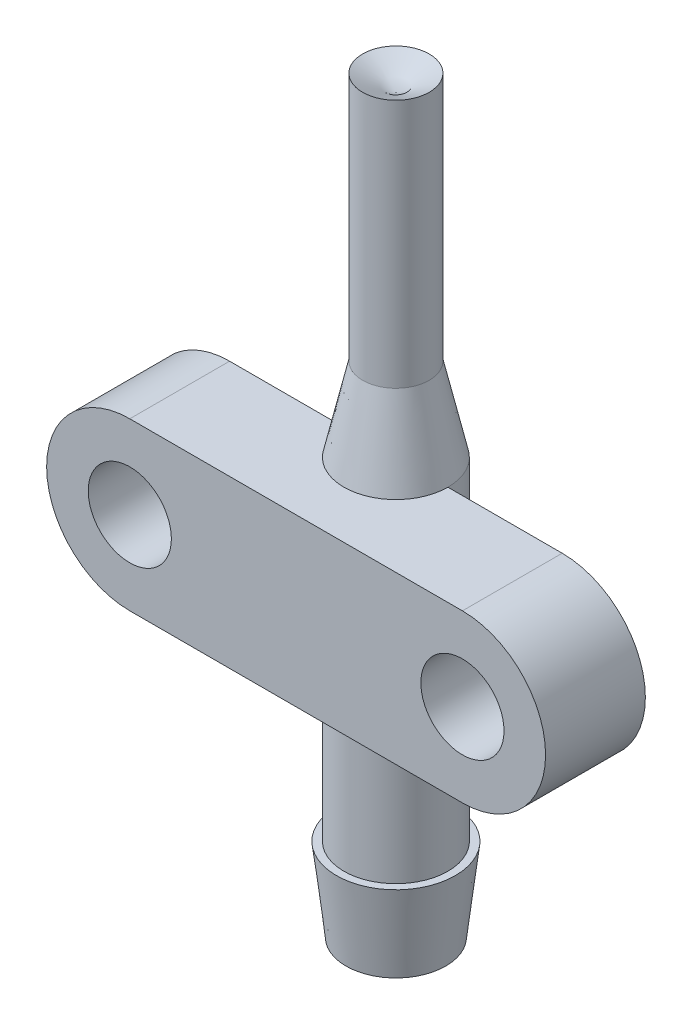
ISO-10303-21;
HEADER;
FILE_DESCRIPTION(('STEP AP214'),'2;1');
FILE_NAME('part.step','',(''),(''),'','','');
FILE_SCHEMA(('AUTOMOTIVE_DESIGN { 1 0 10303 214 1 1 1 1 }'));
ENDSEC;
DATA;
#1=APPLICATION_CONTEXT('core data for automotive mechanical design processes');
#2=APPLICATION_PROTOCOL_DEFINITION('international standard','automotive_design',2000,#1);
#3=PRODUCT_CONTEXT('',#1,'mechanical');
#4=PRODUCT('Part','Part','',(#3));
#5=PRODUCT_RELATED_PRODUCT_CATEGORY('part','',(#4));
#6=PRODUCT_DEFINITION_FORMATION('','',#4);
#7=PRODUCT_DEFINITION_CONTEXT('part definition',#1,'design');
#8=PRODUCT_DEFINITION('design','',#6,#7);
#9=PRODUCT_DEFINITION_SHAPE('','',#8);
#10=(LENGTH_UNIT() NAMED_UNIT(*) SI_UNIT(.MILLI.,.METRE.));
#11=(NAMED_UNIT(*) PLANE_ANGLE_UNIT() SI_UNIT($,.RADIAN.));
#12=(NAMED_UNIT(*) SI_UNIT($,.STERADIAN.) SOLID_ANGLE_UNIT());
#13=UNCERTAINTY_MEASURE_WITH_UNIT(LENGTH_MEASURE(1.E-05),#10,'distance_accuracy_value','');
#14=(GEOMETRIC_REPRESENTATION_CONTEXT(3) GLOBAL_UNCERTAINTY_ASSIGNED_CONTEXT((#13)) GLOBAL_UNIT_ASSIGNED_CONTEXT((#10,
#11,#12)) REPRESENTATION_CONTEXT('',''));
#15=CARTESIAN_POINT('',(0.,0.,0.));
#16=DIRECTION('',(0.,0.,1.));
#17=DIRECTION('',(1.,0.,0.));
#18=AXIS2_PLACEMENT_3D('',#15,#16,#17);
#19=CARTESIAN_POINT('',(-10.,20.,0.));
#20=DIRECTION('',(0.,0.,1.));
#21=DIRECTION('',(1.,0.,0.));
#22=AXIS2_PLACEMENT_3D('',#19,#20,#21);
#23=PLANE('',#22);
#24=CARTESIAN_POINT('',(-10.,20.,0.));
#25=DIRECTION('',(0.,0.,1.));
#26=DIRECTION('',(1.,0.,0.));
#27=AXIS2_PLACEMENT_3D('',#24,#25,#26);
#28=CIRCLE('',#27,2.5);
#29=CARTESIAN_POINT('',(-7.5,20.,0.));
#30=VERTEX_POINT('',#29);
#31=EDGE_CURVE('E146',#30,#30,#28,.T.);
#32=ORIENTED_EDGE('',*,*,#31,.T.);
#33=EDGE_LOOP('',(#32));
#34=FACE_BOUND('',#33,.T.);
#35=DIRECTION('',(-1.,0.,0.));
#36=VECTOR('',#35,1.);
#37=CARTESIAN_POINT('',(-10.,25.,0.));
#38=LINE('',#37,#36);
#39=CARTESIAN_POINT('',(-1.75,25.,0.));
#40=VERTEX_POINT('',#39);
#41=CARTESIAN_POINT('',(-10.,25.,0.));
#42=VERTEX_POINT('',#41);
#43=EDGE_CURVE('E87',#40,#42,#38,.T.);
#44=ORIENTED_EDGE('',*,*,#43,.F.);
#45=DIRECTION('',(0.,-1.,0.));
#46=VECTOR('',#45,1.);
#47=CARTESIAN_POINT('',(-1.75,29.9497474683058,0.));
#48=LINE('',#47,#46);
#49=CARTESIAN_POINT('',(-1.75,15.,0.));
#50=VERTEX_POINT('',#49);
#51=EDGE_CURVE('E58',#40,#50,#48,.T.);
#52=ORIENTED_EDGE('',*,*,#51,.T.);
#53=DIRECTION('',(1.,0.,0.));
#54=VECTOR('',#53,1.);
#55=CARTESIAN_POINT('',(-10.,15.,0.));
#56=LINE('',#55,#54);
#57=CARTESIAN_POINT('',(-10.,15.,0.));
#58=VERTEX_POINT('',#57);
#59=EDGE_CURVE('E136',#58,#50,#56,.T.);
#60=ORIENTED_EDGE('',*,*,#59,.F.);
#61=CARTESIAN_POINT('',(-10.,20.,0.));
#62=DIRECTION('',(0.,0.,1.));
#63=DIRECTION('',(1.,0.,0.));
#64=AXIS2_PLACEMENT_3D('',#61,#62,#63);
#65=CIRCLE('',#64,5.);
#66=EDGE_CURVE('E138',#42,#58,#65,.T.);
#67=ORIENTED_EDGE('',*,*,#66,.F.);
#68=EDGE_LOOP('',(#44,#52,#60,#67));
#69=FACE_BOUND('',#68,.T.);
#70=ADVANCED_FACE('F43',(#34,#69),#23,.F.);
#71=CARTESIAN_POINT('',(-10.,20.,6.));
#72=DIRECTION('',(0.,0.,1.));
#73=DIRECTION('',(1.,0.,0.));
#74=AXIS2_PLACEMENT_3D('',#71,#72,#73);
#75=PLANE('',#74);
#76=CARTESIAN_POINT('',(-10.,20.,6.));
#77=DIRECTION('',(0.,0.,1.));
#78=DIRECTION('',(1.,0.,0.));
#79=AXIS2_PLACEMENT_3D('',#76,#77,#78);
#80=CIRCLE('',#79,2.5);
#81=CARTESIAN_POINT('',(-7.5,20.,6.));
#82=VERTEX_POINT('',#81);
#83=EDGE_CURVE('E142',#82,#82,#80,.T.);
#84=ORIENTED_EDGE('',*,*,#83,.F.);
#85=EDGE_LOOP('',(#84));
#86=FACE_BOUND('',#85,.T.);
#87=CARTESIAN_POINT('',(-10.,20.,6.));
#88=DIRECTION('',(0.,0.,1.));
#89=DIRECTION('',(1.,0.,0.));
#90=AXIS2_PLACEMENT_3D('',#87,#88,#89);
#91=CIRCLE('',#90,5.);
#92=CARTESIAN_POINT('',(-10.,25.,6.));
#93=VERTEX_POINT('',#92);
#94=CARTESIAN_POINT('',(-10.,15.,6.));
#95=VERTEX_POINT('',#94);
#96=EDGE_CURVE('E122',#93,#95,#91,.T.);
#97=ORIENTED_EDGE('',*,*,#96,.T.);
#98=DIRECTION('',(1.,0.,0.));
#99=VECTOR('',#98,1.);
#100=CARTESIAN_POINT('',(-10.,15.,6.));
#101=LINE('',#100,#99);
#102=CARTESIAN_POINT('',(10.,15.,6.));
#103=VERTEX_POINT('',#102);
#104=EDGE_CURVE('E94',#95,#103,#101,.T.);
#105=ORIENTED_EDGE('',*,*,#104,.T.);
#106=CARTESIAN_POINT('',(10.,20.,6.));
#107=DIRECTION('',(0.,0.,1.));
#108=DIRECTION('',(1.,0.,0.));
#109=AXIS2_PLACEMENT_3D('',#106,#107,#108);
#110=CIRCLE('',#109,5.);
#111=CARTESIAN_POINT('',(10.,25.,6.));
#112=VERTEX_POINT('',#111);
#113=EDGE_CURVE('E135',#103,#112,#110,.T.);
#114=ORIENTED_EDGE('',*,*,#113,.T.);
#115=DIRECTION('',(-1.,0.,0.));
#116=VECTOR('',#115,1.);
#117=CARTESIAN_POINT('',(-10.,25.,6.));
#118=LINE('',#117,#116);
#119=EDGE_CURVE('E67',#112,#93,#118,.T.);
#120=ORIENTED_EDGE('',*,*,#119,.T.);
#121=EDGE_LOOP('',(#97,#105,#114,#120));
#122=FACE_BOUND('',#121,.T.);
#123=CARTESIAN_POINT('',(10.,20.,6.));
#124=DIRECTION('',(0.,0.,1.));
#125=DIRECTION('',(1.,0.,0.));
#126=AXIS2_PLACEMENT_3D('',#123,#124,#125);
#127=CIRCLE('',#126,2.5);
#128=CARTESIAN_POINT('',(12.5,20.,6.));
#129=VERTEX_POINT('',#128);
#130=EDGE_CURVE('E149',#129,#129,#127,.T.);
#131=ORIENTED_EDGE('',*,*,#130,.F.);
#132=EDGE_LOOP('',(#131));
#133=FACE_BOUND('',#132,.T.);
#134=ADVANCED_FACE('F164',(#86,#122,#133),#75,.T.);
#135=CARTESIAN_POINT('',(1.75,15.,0.));
#136=VERTEX_POINT('',#135);
#137=CARTESIAN_POINT('',(10.,15.,0.));
#138=VERTEX_POINT('',#137);
#139=EDGE_CURVE('E116',#136,#138,#56,.T.);
#140=ORIENTED_EDGE('',*,*,#139,.F.);
#141=DIRECTION('',(0.,-1.,0.));
#142=VECTOR('',#141,1.);
#143=CARTESIAN_POINT('',(1.75,29.9497474683058,0.));
#144=LINE('',#143,#142);
#145=CARTESIAN_POINT('',(1.75,25.,0.));
#146=VERTEX_POINT('',#145);
#147=EDGE_CURVE('E104',#136,#146,#144,.F.);
#148=ORIENTED_EDGE('',*,*,#147,.T.);
#149=CARTESIAN_POINT('',(10.,25.,0.));
#150=VERTEX_POINT('',#149);
#151=EDGE_CURVE('E115',#150,#146,#38,.T.);
#152=ORIENTED_EDGE('',*,*,#151,.F.);
#153=CARTESIAN_POINT('',(10.,20.,0.));
#154=DIRECTION('',(0.,0.,1.));
#155=DIRECTION('',(1.,0.,0.));
#156=AXIS2_PLACEMENT_3D('',#153,#154,#155);
#157=CIRCLE('',#156,5.);
#158=EDGE_CURVE('E125',#138,#150,#157,.T.);
#159=ORIENTED_EDGE('',*,*,#158,.F.);
#160=EDGE_LOOP('',(#140,#148,#152,#159));
#161=FACE_BOUND('',#160,.T.);
#162=CARTESIAN_POINT('',(10.,20.,0.));
#163=DIRECTION('',(0.,0.,1.));
#164=DIRECTION('',(1.,0.,0.));
#165=AXIS2_PLACEMENT_3D('',#162,#163,#164);
#166=CIRCLE('',#165,2.5);
#167=CARTESIAN_POINT('',(12.5,20.,0.));
#168=VERTEX_POINT('',#167);
#169=EDGE_CURVE('E152',#168,#168,#166,.T.);
#170=ORIENTED_EDGE('',*,*,#169,.T.);
#171=EDGE_LOOP('',(#170));
#172=FACE_BOUND('',#171,.T.);
#173=ADVANCED_FACE('F112',(#161,#172),#23,.F.);
#174=CARTESIAN_POINT('',(-10.,20.,6.));
#175=DIRECTION('',(0.,0.,-1.));
#176=DIRECTION('',(-1.,0.,0.));
#177=AXIS2_PLACEMENT_3D('',#174,#175,#176);
#178=CYLINDRICAL_SURFACE('',#177,5.);
#179=ORIENTED_EDGE('',*,*,#66,.T.);
#180=DIRECTION('',(0.,0.,-1.));
#181=VECTOR('',#180,1.);
#182=CARTESIAN_POINT('',(-10.,15.,6.));
#183=LINE('',#182,#181);
#184=EDGE_CURVE('E12',#95,#58,#183,.T.);
#185=ORIENTED_EDGE('',*,*,#184,.F.);
#186=ORIENTED_EDGE('',*,*,#96,.F.);
#187=DIRECTION('',(0.,0.,-1.));
#188=VECTOR('',#187,1.);
#189=CARTESIAN_POINT('',(-10.,25.,6.));
#190=LINE('',#189,#188);
#191=EDGE_CURVE('E129',#93,#42,#190,.T.);
#192=ORIENTED_EDGE('',*,*,#191,.T.);
#193=EDGE_LOOP('',(#179,#185,#186,#192));
#194=FACE_BOUND('',#193,.T.);
#195=ADVANCED_FACE('F45',(#194),#178,.T.);
#196=CARTESIAN_POINT('',(-10.,15.,6.));
#197=DIRECTION('',(0.,1.,0.));
#198=DIRECTION('',(0.,0.,1.));
#199=AXIS2_PLACEMENT_3D('',#196,#197,#198);
#200=PLANE('',#199);
#201=ORIENTED_EDGE('',*,*,#59,.T.);
#202=CARTESIAN_POINT('',(0.,15.,0.));
#203=DIRECTION('',(0.,1.,0.));
#204=DIRECTION('',(0.,0.,1.));
#205=AXIS2_PLACEMENT_3D('',#202,#203,#204);
#206=CIRCLE('',#205,1.75);
#207=EDGE_CURVE('E107',#50,#136,#206,.T.);
#208=ORIENTED_EDGE('',*,*,#207,.T.);
#209=ORIENTED_EDGE('',*,*,#139,.T.);
#210=DIRECTION('',(0.,0.,-1.));
#211=VECTOR('',#210,1.);
#212=CARTESIAN_POINT('',(10.,15.,6.));
#213=LINE('',#212,#211);
#214=EDGE_CURVE('E51',#103,#138,#213,.T.);
#215=ORIENTED_EDGE('',*,*,#214,.F.);
#216=ORIENTED_EDGE('',*,*,#104,.F.);
#217=ORIENTED_EDGE('',*,*,#184,.T.);
#218=EDGE_LOOP('',(#201,#208,#209,#215,#216,#217));
#219=FACE_BOUND('',#218,.T.);
#220=ADVANCED_FACE('F158',(#219),#200,.F.);
#221=CARTESIAN_POINT('',(10.,20.,6.));
#222=DIRECTION('',(0.,0.,-1.));
#223=DIRECTION('',(-1.,0.,0.));
#224=AXIS2_PLACEMENT_3D('',#221,#222,#223);
#225=CYLINDRICAL_SURFACE('',#224,5.);
#226=ORIENTED_EDGE('',*,*,#158,.T.);
#227=DIRECTION('',(0.,0.,-1.));
#228=VECTOR('',#227,1.);
#229=CARTESIAN_POINT('',(10.,25.,6.));
#230=LINE('',#229,#228);
#231=EDGE_CURVE('E121',#112,#150,#230,.T.);
#232=ORIENTED_EDGE('',*,*,#231,.F.);
#233=ORIENTED_EDGE('',*,*,#113,.F.);
#234=ORIENTED_EDGE('',*,*,#214,.T.);
#235=EDGE_LOOP('',(#226,#232,#233,#234));
#236=FACE_BOUND('',#235,.T.);
#237=ADVANCED_FACE('F134',(#236),#225,.T.);
#238=CARTESIAN_POINT('',(-10.,25.,6.));
#239=DIRECTION('',(0.,-1.,0.));
#240=DIRECTION('',(0.,0.,-1.));
#241=AXIS2_PLACEMENT_3D('',#238,#239,#240);
#242=PLANE('',#241);
#243=ORIENTED_EDGE('',*,*,#151,.T.);
#244=CARTESIAN_POINT('',(0.,25.,0.));
#245=DIRECTION('',(0.,-1.,0.));
#246=DIRECTION('',(0.,0.,-1.));
#247=AXIS2_PLACEMENT_3D('',#244,#245,#246);
#248=CIRCLE('',#247,1.75);
#249=EDGE_CURVE('E101',#40,#146,#248,.F.);
#250=ORIENTED_EDGE('',*,*,#249,.F.);
#251=ORIENTED_EDGE('',*,*,#43,.T.);
#252=ORIENTED_EDGE('',*,*,#191,.F.);
#253=ORIENTED_EDGE('',*,*,#119,.F.);
#254=ORIENTED_EDGE('',*,*,#231,.T.);
#255=EDGE_LOOP('',(#243,#250,#251,#252,#253,#254));
#256=FACE_BOUND('',#255,.T.);
#257=ADVANCED_FACE('F119',(#256),#242,.F.);
#258=CARTESIAN_POINT('',(-10.,20.,6.));
#259=DIRECTION('',(0.,0.,-1.));
#260=DIRECTION('',(-1.,0.,0.));
#261=AXIS2_PLACEMENT_3D('',#258,#259,#260);
#262=CYLINDRICAL_SURFACE('',#261,2.5);
#263=ORIENTED_EDGE('',*,*,#83,.T.);
#264=EDGE_LOOP('',(#263));
#265=FACE_BOUND('',#264,.T.);
#266=ORIENTED_EDGE('',*,*,#31,.F.);
#267=EDGE_LOOP('',(#266));
#268=FACE_BOUND('',#267,.T.);
#269=ADVANCED_FACE('F174',(#265,#268),#262,.F.);
#270=CARTESIAN_POINT('',(10.,20.,6.));
#271=DIRECTION('',(0.,0.,-1.));
#272=DIRECTION('',(-1.,0.,0.));
#273=AXIS2_PLACEMENT_3D('',#270,#271,#272);
#274=CYLINDRICAL_SURFACE('',#273,2.5);
#275=ORIENTED_EDGE('',*,*,#130,.T.);
#276=EDGE_LOOP('',(#275));
#277=FACE_BOUND('',#276,.T.);
#278=ORIENTED_EDGE('',*,*,#169,.F.);
#279=EDGE_LOOP('',(#278));
#280=FACE_BOUND('',#279,.T.);
#281=ADVANCED_FACE('F171',(#277,#280),#274,.F.);
#282=CARTESIAN_POINT('',(0.,29.9497474683058,0.));
#283=DIRECTION('',(0.,-1.,0.));
#284=DIRECTION('',(1.,0.,0.));
#285=AXIS2_PLACEMENT_3D('',#282,#283,#284);
#286=CYLINDRICAL_SURFACE('',#285,1.75);
#287=ORIENTED_EDGE('',*,*,#249,.T.);
#288=ORIENTED_EDGE('',*,*,#147,.F.);
#289=ORIENTED_EDGE('',*,*,#207,.F.);
#290=ORIENTED_EDGE('',*,*,#51,.F.);
#291=EDGE_LOOP('',(#287,#288,#289,#290));
#292=FACE_BOUND('',#291,.T.);
#293=ADVANCED_FACE('F103',(#292),#286,.F.);
#294=CLOSED_SHELL('',(#70,#134,#173,#195,#220,#237,#257,#269,#281,#293));
#295=MANIFOLD_SOLID_BREP('B2',#294);
#296=CARTESIAN_POINT('',(0.,40.,0.));
#297=DIRECTION('',(0.,-1.,0.));
#298=DIRECTION('',(1.,0.,0.));
#299=AXIS2_PLACEMENT_3D('',#296,#297,#298);
#300=PLANE('',#299);
#301=CARTESIAN_POINT('',(0.,40.,0.));
#302=DIRECTION('',(0.,-1.,0.));
#303=DIRECTION('',(1.,0.,0.));
#304=AXIS2_PLACEMENT_3D('',#301,#302,#303);
#305=CIRCLE('',#304,1.);
#306=CARTESIAN_POINT('',(1.,40.,0.));
#307=VERTEX_POINT('',#306);
#308=EDGE_CURVE('E41',#307,#307,#305,.T.);
#309=ORIENTED_EDGE('',*,*,#308,.T.);
#310=EDGE_LOOP('',(#309));
#311=FACE_BOUND('',#310,.T.);
#312=ADVANCED_FACE('F258',(#311),#300,.T.);
#313=CARTESIAN_POINT('',(0.,0.,0.));
#314=DIRECTION('',(0.,-1.,0.));
#315=DIRECTION('',(1.,0.,0.));
#316=AXIS2_PLACEMENT_3D('',#313,#314,#315);
#317=CYLINDRICAL_SURFACE('',#316,1.);
#318=CARTESIAN_POINT('',(0.,30.,0.));
#319=DIRECTION('',(0.,-1.,0.));
#320=DIRECTION('',(1.,0.,0.));
#321=AXIS2_PLACEMENT_3D('',#318,#319,#320);
#322=CIRCLE('',#321,1.);
#323=CARTESIAN_POINT('',(1.,30.,0.));
#324=VERTEX_POINT('',#323);
#325=EDGE_CURVE('E264',#324,#324,#322,.T.);
#326=ORIENTED_EDGE('',*,*,#325,.T.);
#327=EDGE_LOOP('',(#326));
#328=FACE_BOUND('',#327,.T.);
#329=ORIENTED_EDGE('',*,*,#308,.F.);
#330=EDGE_LOOP('',(#329));
#331=FACE_BOUND('',#330,.T.);
#332=ADVANCED_FACE('F301',(#328,#331),#317,.F.);
#333=CARTESIAN_POINT('',(0.,30.,0.));
#334=DIRECTION('',(0.,-1.,0.));
#335=DIRECTION('',(1.,0.,0.));
#336=AXIS2_PLACEMENT_3D('',#333,#334,#335);
#337=CONICAL_SURFACE('',#336,1.,0.148889947609497);
#338=CARTESIAN_POINT('',(0.,25.,0.));
#339=DIRECTION('',(0.,-1.,0.));
#340=DIRECTION('',(1.,0.,0.));
#341=AXIS2_PLACEMENT_3D('',#338,#339,#340);
#342=CIRCLE('',#341,1.75);
#343=CARTESIAN_POINT('',(1.75,25.,0.));
#344=VERTEX_POINT('',#343);
#345=EDGE_CURVE('E296',#344,#344,#342,.T.);
#346=ORIENTED_EDGE('',*,*,#345,.T.);
#347=EDGE_LOOP('',(#346));
#348=FACE_BOUND('',#347,.T.);
#349=ORIENTED_EDGE('',*,*,#325,.F.);
#350=EDGE_LOOP('',(#349));
#351=FACE_BOUND('',#350,.T.);
#352=ADVANCED_FACE('F304',(#348,#351),#337,.F.);
#353=CARTESIAN_POINT('',(0.,0.,0.));
#354=DIRECTION('',(0.,-1.,0.));
#355=DIRECTION('',(1.,0.,0.));
#356=AXIS2_PLACEMENT_3D('',#353,#354,#355);
#357=CYLINDRICAL_SURFACE('',#356,1.75);
#358=CARTESIAN_POINT('',(0.,0.,0.));
#359=DIRECTION('',(0.,-1.,0.));
#360=DIRECTION('',(1.,0.,0.));
#361=AXIS2_PLACEMENT_3D('',#358,#359,#360);
#362=CIRCLE('',#361,1.75);
#363=CARTESIAN_POINT('',(1.75,0.,0.));
#364=VERTEX_POINT('',#363);
#365=EDGE_CURVE('E293',#364,#364,#362,.T.);
#366=ORIENTED_EDGE('',*,*,#365,.T.);
#367=EDGE_LOOP('',(#366));
#368=FACE_BOUND('',#367,.T.);
#369=ORIENTED_EDGE('',*,*,#345,.F.);
#370=EDGE_LOOP('',(#369));
#371=FACE_BOUND('',#370,.T.);
#372=ADVANCED_FACE('F306',(#368,#371),#357,.F.);
#373=CARTESIAN_POINT('',(3.,0.,0.));
#374=DIRECTION('',(0.,-1.,0.));
#375=DIRECTION('',(1.,0.,0.));
#376=AXIS2_PLACEMENT_3D('',#373,#374,#375);
#377=PLANE('',#376);
#378=CARTESIAN_POINT('',(0.,0.,0.));
#379=DIRECTION('',(0.,-1.,0.));
#380=DIRECTION('',(1.,0.,0.));
#381=AXIS2_PLACEMENT_3D('',#378,#379,#380);
#382=CIRCLE('',#381,3.);
#383=CARTESIAN_POINT('',(3.,0.,0.));
#384=VERTEX_POINT('',#383);
#385=EDGE_CURVE('E290',#384,#384,#382,.T.);
#386=ORIENTED_EDGE('',*,*,#385,.T.);
#387=EDGE_LOOP('',(#386));
#388=FACE_BOUND('',#387,.T.);
#389=ORIENTED_EDGE('',*,*,#365,.F.);
#390=EDGE_LOOP('',(#389));
#391=FACE_BOUND('',#390,.T.);
#392=ADVANCED_FACE('F313',(#388,#391),#377,.T.);
#393=CARTESIAN_POINT('',(0.,0.,0.));
#394=DIRECTION('',(0.,1.,0.));
#395=DIRECTION('',(-1.,0.,0.));
#396=AXIS2_PLACEMENT_3D('',#393,#394,#395);
#397=CONICAL_SURFACE('',#396,3.,0.11449702676745);
#398=CARTESIAN_POINT('',(0.,5.,0.));
#399=DIRECTION('',(0.,-1.,0.));
#400=DIRECTION('',(1.,0.,0.));
#401=AXIS2_PLACEMENT_3D('',#398,#399,#400);
#402=CIRCLE('',#401,3.575);
#403=CARTESIAN_POINT('',(3.575,5.,0.));
#404=VERTEX_POINT('',#403);
#405=EDGE_CURVE('E287',#404,#404,#402,.T.);
#406=ORIENTED_EDGE('',*,*,#405,.T.);
#407=EDGE_LOOP('',(#406));
#408=FACE_BOUND('',#407,.T.);
#409=ORIENTED_EDGE('',*,*,#385,.F.);
#410=EDGE_LOOP('',(#409));
#411=FACE_BOUND('',#410,.T.);
#412=ADVANCED_FACE('F344',(#408,#411),#397,.T.);
#413=CARTESIAN_POINT('',(3.125,5.,0.));
#414=DIRECTION('',(0.,1.,0.));
#415=DIRECTION('',(-1.,0.,0.));
#416=AXIS2_PLACEMENT_3D('',#413,#414,#415);
#417=PLANE('',#416);
#418=CARTESIAN_POINT('',(0.,5.,0.));
#419=DIRECTION('',(0.,-1.,0.));
#420=DIRECTION('',(1.,0.,0.));
#421=AXIS2_PLACEMENT_3D('',#418,#419,#420);
#422=CIRCLE('',#421,3.125);
#423=CARTESIAN_POINT('',(3.125,5.,0.));
#424=VERTEX_POINT('',#423);
#425=EDGE_CURVE('E284',#424,#424,#422,.T.);
#426=ORIENTED_EDGE('',*,*,#425,.T.);
#427=EDGE_LOOP('',(#426));
#428=FACE_BOUND('',#427,.T.);
#429=ORIENTED_EDGE('',*,*,#405,.F.);
#430=EDGE_LOOP('',(#429));
#431=FACE_BOUND('',#430,.T.);
#432=ADVANCED_FACE('F354',(#428,#431),#417,.T.);
#433=CARTESIAN_POINT('',(0.,0.,0.));
#434=DIRECTION('',(0.,-1.,0.));
#435=DIRECTION('',(1.,0.,0.));
#436=AXIS2_PLACEMENT_3D('',#433,#434,#435);
#437=CYLINDRICAL_SURFACE('',#436,3.125);
#438=CARTESIAN_POINT('',(0.,25.,0.));
#439=DIRECTION('',(0.,-1.,0.));
#440=DIRECTION('',(1.,0.,0.));
#441=AXIS2_PLACEMENT_3D('',#438,#439,#440);
#442=CIRCLE('',#441,3.125);
#443=CARTESIAN_POINT('',(3.125,25.,0.));
#444=VERTEX_POINT('',#443);
#445=EDGE_CURVE('E279',#444,#444,#442,.T.);
#446=ORIENTED_EDGE('',*,*,#445,.T.);
#447=EDGE_LOOP('',(#446));
#448=FACE_BOUND('',#447,.T.);
#449=ORIENTED_EDGE('',*,*,#425,.F.);
#450=EDGE_LOOP('',(#449));
#451=FACE_BOUND('',#450,.T.);
#452=ADVANCED_FACE('F364',(#448,#451),#437,.T.);
#453=CARTESIAN_POINT('',(0.,25.,0.));
#454=DIRECTION('',(0.,-1.,0.));
#455=DIRECTION('',(1.,0.,0.));
#456=AXIS2_PLACEMENT_3D('',#453,#454,#455);
#457=CONICAL_SURFACE('',#456,3.125,0.221314442347791);
#458=CARTESIAN_POINT('',(0.,30.,0.));
#459=DIRECTION('',(0.,-1.,0.));
#460=DIRECTION('',(1.,0.,0.));
#461=AXIS2_PLACEMENT_3D('',#458,#459,#460);
#462=CIRCLE('',#461,2.);
#463=CARTESIAN_POINT('',(2.,30.,0.));
#464=VERTEX_POINT('',#463);
#465=EDGE_CURVE('E276',#464,#464,#462,.T.);
#466=ORIENTED_EDGE('',*,*,#465,.T.);
#467=EDGE_LOOP('',(#466));
#468=FACE_BOUND('',#467,.T.);
#469=ORIENTED_EDGE('',*,*,#445,.F.);
#470=EDGE_LOOP('',(#469));
#471=FACE_BOUND('',#470,.T.);
#472=ADVANCED_FACE('F374',(#468,#471),#457,.T.);
#473=CARTESIAN_POINT('',(0.,0.,0.));
#474=DIRECTION('',(0.,-1.,0.));
#475=DIRECTION('',(1.,0.,0.));
#476=AXIS2_PLACEMENT_3D('',#473,#474,#475);
#477=CYLINDRICAL_SURFACE('',#476,2.);
#478=CARTESIAN_POINT('',(0.,45.,0.));
#479=DIRECTION('',(0.,-1.,0.));
#480=DIRECTION('',(1.,0.,0.));
#481=AXIS2_PLACEMENT_3D('',#478,#479,#480);
#482=CIRCLE('',#481,2.);
#483=CARTESIAN_POINT('',(2.,45.,0.));
#484=VERTEX_POINT('',#483);
#485=EDGE_CURVE('E274',#484,#484,#482,.T.);
#486=ORIENTED_EDGE('',*,*,#485,.T.);
#487=EDGE_LOOP('',(#486));
#488=FACE_BOUND('',#487,.T.);
#489=ORIENTED_EDGE('',*,*,#465,.F.);
#490=EDGE_LOOP('',(#489));
#491=FACE_BOUND('',#490,.T.);
#492=ADVANCED_FACE('F270',(#488,#491),#477,.T.);
#493=CARTESIAN_POINT('',(0.,45.,0.));
#494=DIRECTION('',(0.,1.,0.));
#495=DIRECTION('',(-1.,0.,0.));
#496=AXIS2_PLACEMENT_3D('',#493,#494,#495);
#497=CONICAL_SURFACE('',#496,2.,1.10714871779409);
#498=CARTESIAN_POINT('',(0.,44.,0.));
#499=VERTEX_POINT('',#498);
#500=VERTEX_LOOP('',#499);
#501=FACE_BOUND('',#500,.T.);
#502=ORIENTED_EDGE('',*,*,#485,.F.);
#503=EDGE_LOOP('',(#502));
#504=FACE_BOUND('',#503,.T.);
#505=ADVANCED_FACE('F267',(#501,#504),#497,.F.);
#506=CLOSED_SHELL('',(#312,#332,#352,#372,#392,#412,#432,#452,#472,#492,#505));
#507=MANIFOLD_SOLID_BREP('B6',#506);
#508=ADVANCED_BREP_SHAPE_REPRESENTATION('',(#18,#295,#507),#14);
#509=SHAPE_DEFINITION_REPRESENTATION(#9,#508);
ENDSEC;
END-ISO-10303-21;
